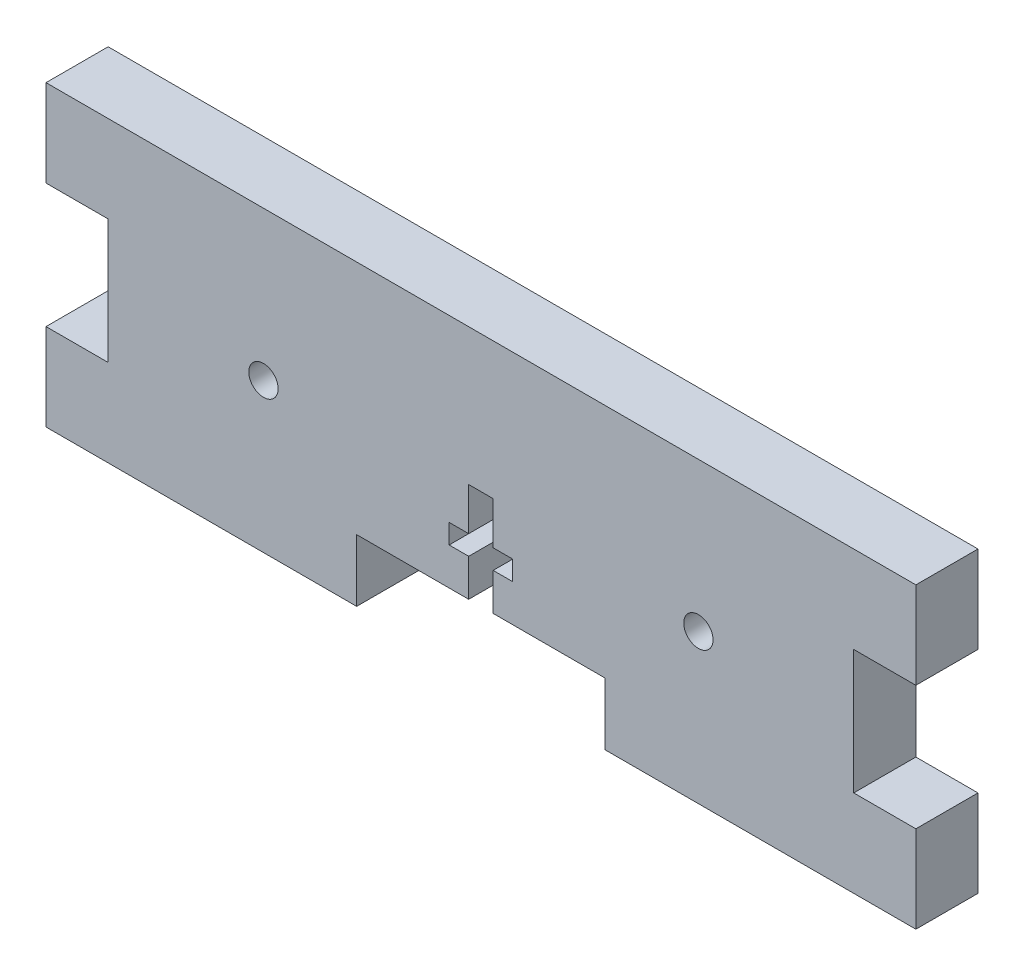
ISO-10303-21;
HEADER;
FILE_DESCRIPTION(('STEP AP214'),'2;1');
FILE_NAME('part.step','',(''),(''),'','','');
FILE_SCHEMA(('AUTOMOTIVE_DESIGN { 1 0 10303 214 1 1 1 1 }'));
ENDSEC;
DATA;
#1=APPLICATION_CONTEXT('core data for automotive mechanical design processes');
#2=APPLICATION_PROTOCOL_DEFINITION('international standard','automotive_design',2000,#1);
#3=PRODUCT_CONTEXT('',#1,'mechanical');
#4=PRODUCT('Part','Part','',(#3));
#5=PRODUCT_RELATED_PRODUCT_CATEGORY('part','',(#4));
#6=PRODUCT_DEFINITION_FORMATION('','',#4);
#7=PRODUCT_DEFINITION_CONTEXT('part definition',#1,'design');
#8=PRODUCT_DEFINITION('design','',#6,#7);
#9=PRODUCT_DEFINITION_SHAPE('','',#8);
#10=(LENGTH_UNIT() NAMED_UNIT(*) SI_UNIT(.MILLI.,.METRE.));
#11=(NAMED_UNIT(*) PLANE_ANGLE_UNIT() SI_UNIT($,.RADIAN.));
#12=(NAMED_UNIT(*) SI_UNIT($,.STERADIAN.) SOLID_ANGLE_UNIT());
#13=UNCERTAINTY_MEASURE_WITH_UNIT(LENGTH_MEASURE(1.E-05),#10,'distance_accuracy_value','');
#14=(GEOMETRIC_REPRESENTATION_CONTEXT(3) GLOBAL_UNCERTAINTY_ASSIGNED_CONTEXT((#13)) GLOBAL_UNIT_ASSIGNED_CONTEXT((#10,
#11,#12)) REPRESENTATION_CONTEXT('',''));
#15=CARTESIAN_POINT('',(0.,0.,0.));
#16=DIRECTION('',(0.,0.,1.));
#17=DIRECTION('',(1.,0.,0.));
#18=AXIS2_PLACEMENT_3D('',#15,#16,#17);
#19=CARTESIAN_POINT('',(31.75,6.35,0.));
#20=DIRECTION('',(0.,1.,0.));
#21=DIRECTION('',(0.,0.,1.));
#22=AXIS2_PLACEMENT_3D('',#19,#20,#21);
#23=PLANE('',#22);
#24=DIRECTION('',(0.,0.,1.));
#25=VECTOR('',#24,1.);
#26=CARTESIAN_POINT('',(43.2,6.35,0.));
#27=LINE('',#26,#25);
#28=CARTESIAN_POINT('',(43.2,6.35,0.));
#29=VERTEX_POINT('',#28);
#30=CARTESIAN_POINT('',(43.2,6.35,6.35));
#31=VERTEX_POINT('',#30);
#32=EDGE_CURVE('E310',#29,#31,#27,.T.);
#33=ORIENTED_EDGE('',*,*,#32,.T.);
#34=DIRECTION('',(-1.,0.,0.));
#35=VECTOR('',#34,1.);
#36=CARTESIAN_POINT('',(31.75,6.35,6.35));
#37=LINE('',#36,#35);
#38=CARTESIAN_POINT('',(31.75,6.35,6.35));
#39=VERTEX_POINT('',#38);
#40=EDGE_CURVE('E341',#31,#39,#37,.T.);
#41=ORIENTED_EDGE('',*,*,#40,.T.);
#42=DIRECTION('',(0.,0.,1.));
#43=VECTOR('',#42,1.);
#44=CARTESIAN_POINT('',(31.75,6.35,0.));
#45=LINE('',#44,#43);
#46=CARTESIAN_POINT('',(31.75,6.35,0.));
#47=VERTEX_POINT('',#46);
#48=EDGE_CURVE('E344',#47,#39,#45,.T.);
#49=ORIENTED_EDGE('',*,*,#48,.F.);
#50=DIRECTION('',(-1.,0.,0.));
#51=VECTOR('',#50,1.);
#52=CARTESIAN_POINT('',(31.75,6.35,0.));
#53=LINE('',#52,#51);
#54=EDGE_CURVE('E334',#29,#47,#53,.T.);
#55=ORIENTED_EDGE('',*,*,#54,.F.);
#56=EDGE_LOOP('',(#33,#41,#49,#55));
#57=FACE_BOUND('',#56,.T.);
#58=ADVANCED_FACE('F33',(#57),#23,.F.);
#59=CARTESIAN_POINT('',(0.,0.,6.35));
#60=DIRECTION('',(0.,1.,0.));
#61=DIRECTION('',(0.,0.,1.));
#62=AXIS2_PLACEMENT_3D('',#59,#60,#61);
#63=PLANE('',#62);
#64=DIRECTION('',(1.,0.,0.));
#65=VECTOR('',#64,1.);
#66=CARTESIAN_POINT('',(0.,0.,0.));
#67=LINE('',#66,#65);
#68=CARTESIAN_POINT('',(0.,0.,0.));
#69=VERTEX_POINT('',#68);
#70=CARTESIAN_POINT('',(31.75,0.,0.));
#71=VERTEX_POINT('',#70);
#72=EDGE_CURVE('E386',#69,#71,#67,.T.);
#73=ORIENTED_EDGE('',*,*,#72,.T.);
#74=DIRECTION('',(0.,0.,1.));
#75=VECTOR('',#74,1.);
#76=CARTESIAN_POINT('',(31.75,0.,0.));
#77=LINE('',#76,#75);
#78=CARTESIAN_POINT('',(31.75,0.,6.35));
#79=VERTEX_POINT('',#78);
#80=EDGE_CURVE('E336',#71,#79,#77,.T.);
#81=ORIENTED_EDGE('',*,*,#80,.T.);
#82=DIRECTION('',(1.,0.,0.));
#83=VECTOR('',#82,1.);
#84=CARTESIAN_POINT('',(0.,0.,6.35));
#85=LINE('',#84,#83);
#86=CARTESIAN_POINT('',(0.,0.,6.35));
#87=VERTEX_POINT('',#86);
#88=EDGE_CURVE('E359',#87,#79,#85,.T.);
#89=ORIENTED_EDGE('',*,*,#88,.F.);
#90=DIRECTION('',(0.,0.,-1.));
#91=VECTOR('',#90,1.);
#92=CARTESIAN_POINT('',(0.,0.,6.35));
#93=LINE('',#92,#91);
#94=EDGE_CURVE('E11',#87,#69,#93,.T.);
#95=ORIENTED_EDGE('',*,*,#94,.T.);
#96=EDGE_LOOP('',(#73,#81,#89,#95));
#97=FACE_BOUND('',#96,.T.);
#98=ADVANCED_FACE('F513',(#97),#63,.F.);
#99=CARTESIAN_POINT('',(0.,0.,6.35));
#100=DIRECTION('',(1.,0.,0.));
#101=DIRECTION('',(0.,0.,-1.));
#102=AXIS2_PLACEMENT_3D('',#99,#100,#101);
#103=PLANE('',#102);
#104=DIRECTION('',(0.,-1.,0.));
#105=VECTOR('',#104,1.);
#106=CARTESIAN_POINT('',(0.,0.,0.));
#107=LINE('',#106,#105);
#108=CARTESIAN_POINT('',(0.,8.89,0.));
#109=VERTEX_POINT('',#108);
#110=EDGE_CURVE('E347',#109,#69,#107,.T.);
#111=ORIENTED_EDGE('',*,*,#110,.T.);
#112=ORIENTED_EDGE('',*,*,#94,.F.);
#113=DIRECTION('',(0.,-1.,0.));
#114=VECTOR('',#113,1.);
#115=CARTESIAN_POINT('',(0.,0.,6.35));
#116=LINE('',#115,#114);
#117=CARTESIAN_POINT('',(0.,8.89,6.35));
#118=VERTEX_POINT('',#117);
#119=EDGE_CURVE('E354',#118,#87,#116,.T.);
#120=ORIENTED_EDGE('',*,*,#119,.F.);
#121=DIRECTION('',(0.,0.,-1.));
#122=VECTOR('',#121,1.);
#123=CARTESIAN_POINT('',(0.,8.89,6.35));
#124=LINE('',#123,#122);
#125=EDGE_CURVE('E382',#118,#109,#124,.T.);
#126=ORIENTED_EDGE('',*,*,#125,.T.);
#127=EDGE_LOOP('',(#111,#112,#120,#126));
#128=FACE_BOUND('',#127,.T.);
#129=ADVANCED_FACE('F35',(#128),#103,.F.);
#130=CARTESIAN_POINT('',(57.15,0.,6.35));
#131=VERTEX_POINT('',#130);
#132=CARTESIAN_POINT('',(88.9,0.,6.35));
#133=VERTEX_POINT('',#132);
#134=EDGE_CURVE('E357',#131,#133,#85,.T.);
#135=ORIENTED_EDGE('',*,*,#134,.F.);
#136=DIRECTION('',(0.,0.,1.));
#137=VECTOR('',#136,1.);
#138=CARTESIAN_POINT('',(57.15,0.,0.));
#139=LINE('',#138,#137);
#140=CARTESIAN_POINT('',(57.15,0.,0.));
#141=VERTEX_POINT('',#140);
#142=EDGE_CURVE('E350',#141,#131,#139,.T.);
#143=ORIENTED_EDGE('',*,*,#142,.F.);
#144=CARTESIAN_POINT('',(88.9,0.,0.));
#145=VERTEX_POINT('',#144);
#146=EDGE_CURVE('E385',#141,#145,#67,.T.);
#147=ORIENTED_EDGE('',*,*,#146,.T.);
#148=DIRECTION('',(0.,0.,-1.));
#149=VECTOR('',#148,1.);
#150=CARTESIAN_POINT('',(88.9,0.,6.35));
#151=LINE('',#150,#149);
#152=EDGE_CURVE('E41',#133,#145,#151,.T.);
#153=ORIENTED_EDGE('',*,*,#152,.F.);
#154=EDGE_LOOP('',(#135,#143,#147,#153));
#155=FACE_BOUND('',#154,.T.);
#156=ADVANCED_FACE('F466',(#155),#63,.F.);
#157=CARTESIAN_POINT('',(88.9,0.,6.35));
#158=DIRECTION('',(-1.,0.,0.));
#159=DIRECTION('',(0.,0.,1.));
#160=AXIS2_PLACEMENT_3D('',#157,#158,#159);
#161=PLANE('',#160);
#162=DIRECTION('',(0.,1.,0.));
#163=VECTOR('',#162,1.);
#164=CARTESIAN_POINT('',(88.9,0.,0.));
#165=LINE('',#164,#163);
#166=CARTESIAN_POINT('',(88.9,8.89,0.));
#167=VERTEX_POINT('',#166);
#168=EDGE_CURVE('E389',#145,#167,#165,.T.);
#169=ORIENTED_EDGE('',*,*,#168,.T.);
#170=DIRECTION('',(0.,0.,-1.));
#171=VECTOR('',#170,1.);
#172=CARTESIAN_POINT('',(88.9,8.89,6.35));
#173=LINE('',#172,#171);
#174=CARTESIAN_POINT('',(88.9,8.89,6.35));
#175=VERTEX_POINT('',#174);
#176=EDGE_CURVE('E434',#175,#167,#173,.T.);
#177=ORIENTED_EDGE('',*,*,#176,.F.);
#178=DIRECTION('',(0.,1.,0.));
#179=VECTOR('',#178,1.);
#180=CARTESIAN_POINT('',(88.9,0.,6.35));
#181=LINE('',#180,#179);
#182=EDGE_CURVE('E362',#133,#175,#181,.T.);
#183=ORIENTED_EDGE('',*,*,#182,.F.);
#184=ORIENTED_EDGE('',*,*,#152,.T.);
#185=EDGE_LOOP('',(#169,#177,#183,#184));
#186=FACE_BOUND('',#185,.T.);
#187=ADVANCED_FACE('F441',(#186),#161,.F.);
#188=CARTESIAN_POINT('',(88.9,8.89,6.35));
#189=DIRECTION('',(0.,-1.,0.));
#190=DIRECTION('',(0.,0.,-1.));
#191=AXIS2_PLACEMENT_3D('',#188,#189,#190);
#192=PLANE('',#191);
#193=DIRECTION('',(-1.,0.,0.));
#194=VECTOR('',#193,1.);
#195=CARTESIAN_POINT('',(88.9,8.89,0.));
#196=LINE('',#195,#194);
#197=CARTESIAN_POINT('',(82.55,8.89,0.));
#198=VERTEX_POINT('',#197);
#199=EDGE_CURVE('E391',#167,#198,#196,.T.);
#200=ORIENTED_EDGE('',*,*,#199,.T.);
#201=DIRECTION('',(0.,0.,-1.));
#202=VECTOR('',#201,1.);
#203=CARTESIAN_POINT('',(82.55,8.89,6.35));
#204=LINE('',#203,#202);
#205=CARTESIAN_POINT('',(82.55,8.89,6.35));
#206=VERTEX_POINT('',#205);
#207=EDGE_CURVE('E431',#206,#198,#204,.T.);
#208=ORIENTED_EDGE('',*,*,#207,.F.);
#209=DIRECTION('',(-1.,0.,0.));
#210=VECTOR('',#209,1.);
#211=CARTESIAN_POINT('',(88.9,8.89,6.35));
#212=LINE('',#211,#210);
#213=EDGE_CURVE('E364',#175,#206,#212,.T.);
#214=ORIENTED_EDGE('',*,*,#213,.F.);
#215=ORIENTED_EDGE('',*,*,#176,.T.);
#216=EDGE_LOOP('',(#200,#208,#214,#215));
#217=FACE_BOUND('',#216,.T.);
#218=ADVANCED_FACE('F451',(#217),#192,.F.);
#219=CARTESIAN_POINT('',(82.55,21.59,6.35));
#220=DIRECTION('',(-1.,0.,0.));
#221=DIRECTION('',(0.,0.,1.));
#222=AXIS2_PLACEMENT_3D('',#219,#220,#221);
#223=PLANE('',#222);
#224=DIRECTION('',(0.,1.,0.));
#225=VECTOR('',#224,1.);
#226=CARTESIAN_POINT('',(82.55,21.59,0.));
#227=LINE('',#226,#225);
#228=CARTESIAN_POINT('',(82.55,21.59,0.));
#229=VERTEX_POINT('',#228);
#230=EDGE_CURVE('E393',#198,#229,#227,.T.);
#231=ORIENTED_EDGE('',*,*,#230,.T.);
#232=DIRECTION('',(0.,0.,-1.));
#233=VECTOR('',#232,1.);
#234=CARTESIAN_POINT('',(82.55,21.59,6.35));
#235=LINE('',#234,#233);
#236=CARTESIAN_POINT('',(82.55,21.59,6.35));
#237=VERTEX_POINT('',#236);
#238=EDGE_CURVE('E428',#237,#229,#235,.T.);
#239=ORIENTED_EDGE('',*,*,#238,.F.);
#240=DIRECTION('',(0.,1.,0.));
#241=VECTOR('',#240,1.);
#242=CARTESIAN_POINT('',(82.55,21.59,6.35));
#243=LINE('',#242,#241);
#244=EDGE_CURVE('E366',#206,#237,#243,.T.);
#245=ORIENTED_EDGE('',*,*,#244,.F.);
#246=ORIENTED_EDGE('',*,*,#207,.T.);
#247=EDGE_LOOP('',(#231,#239,#245,#246));
#248=FACE_BOUND('',#247,.T.);
#249=ADVANCED_FACE('F455',(#248),#223,.F.);
#250=CARTESIAN_POINT('',(88.9,21.59,6.35));
#251=DIRECTION('',(0.,1.,0.));
#252=DIRECTION('',(0.,0.,1.));
#253=AXIS2_PLACEMENT_3D('',#250,#251,#252);
#254=PLANE('',#253);
#255=DIRECTION('',(1.,0.,0.));
#256=VECTOR('',#255,1.);
#257=CARTESIAN_POINT('',(88.9,21.59,0.));
#258=LINE('',#257,#256);
#259=CARTESIAN_POINT('',(88.9,21.59,0.));
#260=VERTEX_POINT('',#259);
#261=EDGE_CURVE('E395',#229,#260,#258,.T.);
#262=ORIENTED_EDGE('',*,*,#261,.T.);
#263=DIRECTION('',(0.,0.,-1.));
#264=VECTOR('',#263,1.);
#265=CARTESIAN_POINT('',(88.9,21.59,6.35));
#266=LINE('',#265,#264);
#267=CARTESIAN_POINT('',(88.9,21.59,6.35));
#268=VERTEX_POINT('',#267);
#269=EDGE_CURVE('E425',#268,#260,#266,.T.);
#270=ORIENTED_EDGE('',*,*,#269,.F.);
#271=DIRECTION('',(1.,0.,0.));
#272=VECTOR('',#271,1.);
#273=CARTESIAN_POINT('',(88.9,21.59,6.35));
#274=LINE('',#273,#272);
#275=EDGE_CURVE('E368',#237,#268,#274,.T.);
#276=ORIENTED_EDGE('',*,*,#275,.F.);
#277=ORIENTED_EDGE('',*,*,#238,.T.);
#278=EDGE_LOOP('',(#262,#270,#276,#277));
#279=FACE_BOUND('',#278,.T.);
#280=ADVANCED_FACE('F548',(#279),#254,.F.);
#281=CARTESIAN_POINT('',(88.9,21.59,6.35));
#282=DIRECTION('',(-1.,0.,0.));
#283=DIRECTION('',(0.,0.,1.));
#284=AXIS2_PLACEMENT_3D('',#281,#282,#283);
#285=PLANE('',#284);
#286=DIRECTION('',(0.,1.,0.));
#287=VECTOR('',#286,1.);
#288=CARTESIAN_POINT('',(88.9,21.59,0.));
#289=LINE('',#288,#287);
#290=CARTESIAN_POINT('',(88.9,30.48,0.));
#291=VERTEX_POINT('',#290);
#292=EDGE_CURVE('E397',#260,#291,#289,.T.);
#293=ORIENTED_EDGE('',*,*,#292,.T.);
#294=DIRECTION('',(0.,0.,-1.));
#295=VECTOR('',#294,1.);
#296=CARTESIAN_POINT('',(88.9,30.48,6.35));
#297=LINE('',#296,#295);
#298=CARTESIAN_POINT('',(88.9,30.48,6.35));
#299=VERTEX_POINT('',#298);
#300=EDGE_CURVE('E422',#299,#291,#297,.T.);
#301=ORIENTED_EDGE('',*,*,#300,.F.);
#302=DIRECTION('',(0.,1.,0.));
#303=VECTOR('',#302,1.);
#304=CARTESIAN_POINT('',(88.9,21.59,6.35));
#305=LINE('',#304,#303);
#306=EDGE_CURVE('E370',#268,#299,#305,.T.);
#307=ORIENTED_EDGE('',*,*,#306,.F.);
#308=ORIENTED_EDGE('',*,*,#269,.T.);
#309=EDGE_LOOP('',(#293,#301,#307,#308));
#310=FACE_BOUND('',#309,.T.);
#311=ADVANCED_FACE('F546',(#310),#285,.F.);
#312=CARTESIAN_POINT('',(0.,30.48,6.35));
#313=DIRECTION('',(0.,-1.,0.));
#314=DIRECTION('',(0.,0.,-1.));
#315=AXIS2_PLACEMENT_3D('',#312,#313,#314);
#316=PLANE('',#315);
#317=DIRECTION('',(-1.,0.,0.));
#318=VECTOR('',#317,1.);
#319=CARTESIAN_POINT('',(0.,30.48,0.));
#320=LINE('',#319,#318);
#321=CARTESIAN_POINT('',(0.,30.48,0.));
#322=VERTEX_POINT('',#321);
#323=EDGE_CURVE('E399',#291,#322,#320,.T.);
#324=ORIENTED_EDGE('',*,*,#323,.T.);
#325=DIRECTION('',(0.,0.,-1.));
#326=VECTOR('',#325,1.);
#327=CARTESIAN_POINT('',(0.,30.48,6.35));
#328=LINE('',#327,#326);
#329=CARTESIAN_POINT('',(0.,30.48,6.35));
#330=VERTEX_POINT('',#329);
#331=EDGE_CURVE('E419',#330,#322,#328,.T.);
#332=ORIENTED_EDGE('',*,*,#331,.F.);
#333=DIRECTION('',(-1.,0.,0.));
#334=VECTOR('',#333,1.);
#335=CARTESIAN_POINT('',(0.,30.48,6.35));
#336=LINE('',#335,#334);
#337=EDGE_CURVE('E372',#299,#330,#336,.T.);
#338=ORIENTED_EDGE('',*,*,#337,.F.);
#339=ORIENTED_EDGE('',*,*,#300,.T.);
#340=EDGE_LOOP('',(#324,#332,#338,#339));
#341=FACE_BOUND('',#340,.T.);
#342=ADVANCED_FACE('F542',(#341),#316,.F.);
#343=CARTESIAN_POINT('',(0.,21.59,6.35));
#344=DIRECTION('',(1.,0.,0.));
#345=DIRECTION('',(0.,0.,-1.));
#346=AXIS2_PLACEMENT_3D('',#343,#344,#345);
#347=PLANE('',#346);
#348=DIRECTION('',(0.,-1.,0.));
#349=VECTOR('',#348,1.);
#350=CARTESIAN_POINT('',(0.,21.59,0.));
#351=LINE('',#350,#349);
#352=CARTESIAN_POINT('',(0.,21.59,0.));
#353=VERTEX_POINT('',#352);
#354=EDGE_CURVE('E401',#322,#353,#351,.T.);
#355=ORIENTED_EDGE('',*,*,#354,.T.);
#356=DIRECTION('',(0.,0.,-1.));
#357=VECTOR('',#356,1.);
#358=CARTESIAN_POINT('',(0.,21.59,6.35));
#359=LINE('',#358,#357);
#360=CARTESIAN_POINT('',(0.,21.59,6.35));
#361=VERTEX_POINT('',#360);
#362=EDGE_CURVE('E416',#361,#353,#359,.T.);
#363=ORIENTED_EDGE('',*,*,#362,.F.);
#364=DIRECTION('',(0.,-1.,0.));
#365=VECTOR('',#364,1.);
#366=CARTESIAN_POINT('',(0.,21.59,6.35));
#367=LINE('',#366,#365);
#368=EDGE_CURVE('E374',#330,#361,#367,.T.);
#369=ORIENTED_EDGE('',*,*,#368,.F.);
#370=ORIENTED_EDGE('',*,*,#331,.T.);
#371=EDGE_LOOP('',(#355,#363,#369,#370));
#372=FACE_BOUND('',#371,.T.);
#373=ADVANCED_FACE('F537',(#372),#347,.F.);
#374=CARTESIAN_POINT('',(0.,21.59,6.35));
#375=DIRECTION('',(0.,1.,0.));
#376=DIRECTION('',(0.,0.,1.));
#377=AXIS2_PLACEMENT_3D('',#374,#375,#376);
#378=PLANE('',#377);
#379=DIRECTION('',(1.,0.,0.));
#380=VECTOR('',#379,1.);
#381=CARTESIAN_POINT('',(0.,21.59,0.));
#382=LINE('',#381,#380);
#383=CARTESIAN_POINT('',(6.35,21.59,0.));
#384=VERTEX_POINT('',#383);
#385=EDGE_CURVE('E403',#353,#384,#382,.T.);
#386=ORIENTED_EDGE('',*,*,#385,.T.);
#387=DIRECTION('',(0.,0.,-1.));
#388=VECTOR('',#387,1.);
#389=CARTESIAN_POINT('',(6.35,21.59,6.35));
#390=LINE('',#389,#388);
#391=CARTESIAN_POINT('',(6.35,21.59,6.35));
#392=VERTEX_POINT('',#391);
#393=EDGE_CURVE('E413',#392,#384,#390,.T.);
#394=ORIENTED_EDGE('',*,*,#393,.F.);
#395=DIRECTION('',(1.,0.,0.));
#396=VECTOR('',#395,1.);
#397=CARTESIAN_POINT('',(0.,21.59,6.35));
#398=LINE('',#397,#396);
#399=EDGE_CURVE('E376',#361,#392,#398,.T.);
#400=ORIENTED_EDGE('',*,*,#399,.F.);
#401=ORIENTED_EDGE('',*,*,#362,.T.);
#402=EDGE_LOOP('',(#386,#394,#400,#401));
#403=FACE_BOUND('',#402,.T.);
#404=ADVANCED_FACE('F531',(#403),#378,.F.);
#405=CARTESIAN_POINT('',(6.35,21.59,6.35));
#406=DIRECTION('',(1.,0.,0.));
#407=DIRECTION('',(0.,0.,-1.));
#408=AXIS2_PLACEMENT_3D('',#405,#406,#407);
#409=PLANE('',#408);
#410=DIRECTION('',(0.,-1.,0.));
#411=VECTOR('',#410,1.);
#412=CARTESIAN_POINT('',(6.35,21.59,0.));
#413=LINE('',#412,#411);
#414=CARTESIAN_POINT('',(6.35,8.89,0.));
#415=VERTEX_POINT('',#414);
#416=EDGE_CURVE('E405',#384,#415,#413,.T.);
#417=ORIENTED_EDGE('',*,*,#416,.T.);
#418=DIRECTION('',(0.,0.,-1.));
#419=VECTOR('',#418,1.);
#420=CARTESIAN_POINT('',(6.35,8.89,6.35));
#421=LINE('',#420,#419);
#422=CARTESIAN_POINT('',(6.35,8.89,6.35));
#423=VERTEX_POINT('',#422);
#424=EDGE_CURVE('E410',#423,#415,#421,.T.);
#425=ORIENTED_EDGE('',*,*,#424,.F.);
#426=DIRECTION('',(0.,-1.,0.));
#427=VECTOR('',#426,1.);
#428=CARTESIAN_POINT('',(6.35,21.59,6.35));
#429=LINE('',#428,#427);
#430=EDGE_CURVE('E378',#392,#423,#429,.T.);
#431=ORIENTED_EDGE('',*,*,#430,.F.);
#432=ORIENTED_EDGE('',*,*,#393,.T.);
#433=EDGE_LOOP('',(#417,#425,#431,#432));
#434=FACE_BOUND('',#433,.T.);
#435=ADVANCED_FACE('F527',(#434),#409,.F.);
#436=CARTESIAN_POINT('',(0.,8.89,6.35));
#437=DIRECTION('',(0.,-1.,0.));
#438=DIRECTION('',(0.,0.,-1.));
#439=AXIS2_PLACEMENT_3D('',#436,#437,#438);
#440=PLANE('',#439);
#441=DIRECTION('',(-1.,0.,0.));
#442=VECTOR('',#441,1.);
#443=CARTESIAN_POINT('',(0.,8.89,0.));
#444=LINE('',#443,#442);
#445=EDGE_CURVE('E358',#415,#109,#444,.T.);
#446=ORIENTED_EDGE('',*,*,#445,.T.);
#447=ORIENTED_EDGE('',*,*,#125,.F.);
#448=DIRECTION('',(-1.,0.,0.));
#449=VECTOR('',#448,1.);
#450=CARTESIAN_POINT('',(0.,8.89,6.35));
#451=LINE('',#450,#449);
#452=EDGE_CURVE('E380',#423,#118,#451,.T.);
#453=ORIENTED_EDGE('',*,*,#452,.F.);
#454=ORIENTED_EDGE('',*,*,#424,.T.);
#455=EDGE_LOOP('',(#446,#447,#453,#454));
#456=FACE_BOUND('',#455,.T.);
#457=ADVANCED_FACE('F522',(#456),#440,.F.);
#458=CARTESIAN_POINT('',(0.,0.,6.35));
#459=DIRECTION('',(0.,0.,-1.));
#460=DIRECTION('',(-1.,0.,0.));
#461=AXIS2_PLACEMENT_3D('',#458,#459,#460);
#462=PLANE('',#461);
#463=DIRECTION('',(1.,0.,0.));
#464=VECTOR('',#463,1.);
#465=CARTESIAN_POINT('',(45.7,10.16,6.35));
#466=LINE('',#465,#464);
#467=CARTESIAN_POINT('',(45.7,10.16,6.35));
#468=VERTEX_POINT('',#467);
#469=CARTESIAN_POINT('',(47.7,10.16,6.35));
#470=VERTEX_POINT('',#469);
#471=EDGE_CURVE('E279',#468,#470,#466,.T.);
#472=ORIENTED_EDGE('',*,*,#471,.F.);
#473=DIRECTION('',(0.,1.,0.));
#474=VECTOR('',#473,1.);
#475=CARTESIAN_POINT('',(45.7,6.35,6.35));
#476=LINE('',#475,#474);
#477=CARTESIAN_POINT('',(45.7,6.35,6.35));
#478=VERTEX_POINT('',#477);
#479=EDGE_CURVE('E276',#478,#468,#476,.T.);
#480=ORIENTED_EDGE('',*,*,#479,.F.);
#481=CARTESIAN_POINT('',(57.15,6.35,6.35));
#482=VERTEX_POINT('',#481);
#483=EDGE_CURVE('E331',#482,#478,#37,.T.);
#484=ORIENTED_EDGE('',*,*,#483,.F.);
#485=DIRECTION('',(0.,1.,0.));
#486=VECTOR('',#485,1.);
#487=CARTESIAN_POINT('',(57.15,0.,6.35));
#488=LINE('',#487,#486);
#489=EDGE_CURVE('E338',#131,#482,#488,.T.);
#490=ORIENTED_EDGE('',*,*,#489,.F.);
#491=ORIENTED_EDGE('',*,*,#134,.T.);
#492=ORIENTED_EDGE('',*,*,#182,.T.);
#493=ORIENTED_EDGE('',*,*,#213,.T.);
#494=ORIENTED_EDGE('',*,*,#244,.T.);
#495=ORIENTED_EDGE('',*,*,#275,.T.);
#496=ORIENTED_EDGE('',*,*,#306,.T.);
#497=ORIENTED_EDGE('',*,*,#337,.T.);
#498=ORIENTED_EDGE('',*,*,#368,.T.);
#499=ORIENTED_EDGE('',*,*,#399,.T.);
#500=ORIENTED_EDGE('',*,*,#430,.T.);
#501=ORIENTED_EDGE('',*,*,#452,.T.);
#502=ORIENTED_EDGE('',*,*,#119,.T.);
#503=ORIENTED_EDGE('',*,*,#88,.T.);
#504=DIRECTION('',(0.,-1.,0.));
#505=VECTOR('',#504,1.);
#506=CARTESIAN_POINT('',(31.75,0.,6.35));
#507=LINE('',#506,#505);
#508=EDGE_CURVE('E324',#39,#79,#507,.T.);
#509=ORIENTED_EDGE('',*,*,#508,.F.);
#510=ORIENTED_EDGE('',*,*,#40,.F.);
#511=DIRECTION('',(0.,1.,0.));
#512=VECTOR('',#511,1.);
#513=CARTESIAN_POINT('',(43.2,6.35,6.35));
#514=LINE('',#513,#512);
#515=CARTESIAN_POINT('',(43.2,10.16,6.35));
#516=VERTEX_POINT('',#515);
#517=EDGE_CURVE('E48',#31,#516,#514,.T.);
#518=ORIENTED_EDGE('',*,*,#517,.T.);
#519=DIRECTION('',(-1.,0.,0.));
#520=VECTOR('',#519,1.);
#521=CARTESIAN_POINT('',(43.2,10.16,6.35));
#522=LINE('',#521,#520);
#523=CARTESIAN_POINT('',(41.2,10.16,6.35));
#524=VERTEX_POINT('',#523);
#525=EDGE_CURVE('E272',#516,#524,#522,.T.);
#526=ORIENTED_EDGE('',*,*,#525,.T.);
#527=DIRECTION('',(0.,-1.,0.));
#528=VECTOR('',#527,1.);
#529=CARTESIAN_POINT('',(41.2,12.16,6.35));
#530=LINE('',#529,#528);
#531=CARTESIAN_POINT('',(41.2,12.16,6.35));
#532=VERTEX_POINT('',#531);
#533=EDGE_CURVE('E270',#532,#524,#530,.T.);
#534=ORIENTED_EDGE('',*,*,#533,.F.);
#535=DIRECTION('',(-1.,0.,0.));
#536=VECTOR('',#535,1.);
#537=CARTESIAN_POINT('',(43.2,12.16,6.35));
#538=LINE('',#537,#536);
#539=CARTESIAN_POINT('',(43.2,12.16,6.35));
#540=VERTEX_POINT('',#539);
#541=EDGE_CURVE('E226',#540,#532,#538,.T.);
#542=ORIENTED_EDGE('',*,*,#541,.F.);
#543=DIRECTION('',(0.,1.,0.));
#544=VECTOR('',#543,1.);
#545=CARTESIAN_POINT('',(43.2,12.16,6.35));
#546=LINE('',#545,#544);
#547=CARTESIAN_POINT('',(43.2,16.51,6.35));
#548=VERTEX_POINT('',#547);
#549=EDGE_CURVE('E245',#540,#548,#546,.T.);
#550=ORIENTED_EDGE('',*,*,#549,.T.);
#551=DIRECTION('',(1.,0.,0.));
#552=VECTOR('',#551,1.);
#553=CARTESIAN_POINT('',(43.2,16.51,6.35));
#554=LINE('',#553,#552);
#555=CARTESIAN_POINT('',(45.7,16.51,6.35));
#556=VERTEX_POINT('',#555);
#557=EDGE_CURVE('E248',#548,#556,#554,.T.);
#558=ORIENTED_EDGE('',*,*,#557,.T.);
#559=DIRECTION('',(0.,1.,0.));
#560=VECTOR('',#559,1.);
#561=CARTESIAN_POINT('',(45.7,12.16,6.35));
#562=LINE('',#561,#560);
#563=CARTESIAN_POINT('',(45.7,12.16,6.35));
#564=VERTEX_POINT('',#563);
#565=EDGE_CURVE('E288',#564,#556,#562,.T.);
#566=ORIENTED_EDGE('',*,*,#565,.F.);
#567=DIRECTION('',(1.,0.,0.));
#568=VECTOR('',#567,1.);
#569=CARTESIAN_POINT('',(45.7,12.16,6.35));
#570=LINE('',#569,#568);
#571=CARTESIAN_POINT('',(47.7,12.16,6.35));
#572=VERTEX_POINT('',#571);
#573=EDGE_CURVE('E285',#564,#572,#570,.T.);
#574=ORIENTED_EDGE('',*,*,#573,.T.);
#575=DIRECTION('',(0.,-1.,0.));
#576=VECTOR('',#575,1.);
#577=CARTESIAN_POINT('',(47.7,12.16,6.35));
#578=LINE('',#577,#576);
#579=EDGE_CURVE('E282',#572,#470,#578,.T.);
#580=ORIENTED_EDGE('',*,*,#579,.T.);
#581=EDGE_LOOP('',(#472,#480,#484,#490,#491,#492,#493,#494,#495,#496,#497,#498,#499,#500,#501,
#502,#503,#509,#510,#518,#526,#534,#542,#550,#558,#566,#574,#580));
#582=FACE_BOUND('',#581,.T.);
#583=CARTESIAN_POINT('',(66.675,15.24,6.35));
#584=DIRECTION('',(0.,0.,1.));
#585=DIRECTION('',(1.,0.,0.));
#586=AXIS2_PLACEMENT_3D('',#583,#584,#585);
#587=CIRCLE('',#586,1.5);
#588=CARTESIAN_POINT('',(68.175,15.24,6.35));
#589=VERTEX_POINT('',#588);
#590=EDGE_CURVE('E295',#589,#589,#587,.T.);
#591=ORIENTED_EDGE('',*,*,#590,.F.);
#592=EDGE_LOOP('',(#591));
#593=FACE_BOUND('',#592,.T.);
#594=CARTESIAN_POINT('',(22.225,15.24,6.35));
#595=DIRECTION('',(0.,0.,1.));
#596=DIRECTION('',(1.,0.,0.));
#597=AXIS2_PLACEMENT_3D('',#594,#595,#596);
#598=CIRCLE('',#597,1.5);
#599=CARTESIAN_POINT('',(23.725,15.24,6.35));
#600=VERTEX_POINT('',#599);
#601=EDGE_CURVE('E318',#600,#600,#598,.T.);
#602=ORIENTED_EDGE('',*,*,#601,.F.);
#603=EDGE_LOOP('',(#602));
#604=FACE_BOUND('',#603,.T.);
#605=ADVANCED_FACE('F460',(#582,#593,#604),#462,.F.);
#606=CARTESIAN_POINT('',(0.,0.,0.));
#607=DIRECTION('',(0.,0.,-1.));
#608=DIRECTION('',(-1.,0.,0.));
#609=AXIS2_PLACEMENT_3D('',#606,#607,#608);
#610=PLANE('',#609);
#611=DIRECTION('',(0.,1.,0.));
#612=VECTOR('',#611,1.);
#613=CARTESIAN_POINT('',(45.7,6.35,0.));
#614=LINE('',#613,#612);
#615=CARTESIAN_POINT('',(45.7,6.35,0.));
#616=VERTEX_POINT('',#615);
#617=CARTESIAN_POINT('',(45.7,10.16,0.));
#618=VERTEX_POINT('',#617);
#619=EDGE_CURVE('E254',#616,#618,#614,.T.);
#620=ORIENTED_EDGE('',*,*,#619,.T.);
#621=DIRECTION('',(1.,0.,0.));
#622=VECTOR('',#621,1.);
#623=CARTESIAN_POINT('',(45.7,10.16,0.));
#624=LINE('',#623,#622);
#625=CARTESIAN_POINT('',(47.7,10.16,0.));
#626=VERTEX_POINT('',#625);
#627=EDGE_CURVE('E256',#618,#626,#624,.T.);
#628=ORIENTED_EDGE('',*,*,#627,.T.);
#629=DIRECTION('',(0.,-1.,0.));
#630=VECTOR('',#629,1.);
#631=CARTESIAN_POINT('',(47.7,12.16,0.));
#632=LINE('',#631,#630);
#633=CARTESIAN_POINT('',(47.7,12.16,0.));
#634=VERTEX_POINT('',#633);
#635=EDGE_CURVE('E259',#634,#626,#632,.T.);
#636=ORIENTED_EDGE('',*,*,#635,.F.);
#637=DIRECTION('',(1.,0.,0.));
#638=VECTOR('',#637,1.);
#639=CARTESIAN_POINT('',(45.7,12.16,0.));
#640=LINE('',#639,#638);
#641=CARTESIAN_POINT('',(45.7,12.16,0.));
#642=VERTEX_POINT('',#641);
#643=EDGE_CURVE('E261',#642,#634,#640,.T.);
#644=ORIENTED_EDGE('',*,*,#643,.F.);
#645=DIRECTION('',(0.,1.,0.));
#646=VECTOR('',#645,1.);
#647=CARTESIAN_POINT('',(45.7,12.16,0.));
#648=LINE('',#647,#646);
#649=CARTESIAN_POINT('',(45.7,16.51,0.));
#650=VERTEX_POINT('',#649);
#651=EDGE_CURVE('E263',#642,#650,#648,.T.);
#652=ORIENTED_EDGE('',*,*,#651,.T.);
#653=DIRECTION('',(1.,0.,0.));
#654=VECTOR('',#653,1.);
#655=CARTESIAN_POINT('',(43.2,16.51,0.));
#656=LINE('',#655,#654);
#657=CARTESIAN_POINT('',(43.2,16.51,0.));
#658=VERTEX_POINT('',#657);
#659=EDGE_CURVE('E266',#658,#650,#656,.T.);
#660=ORIENTED_EDGE('',*,*,#659,.F.);
#661=DIRECTION('',(0.,1.,0.));
#662=VECTOR('',#661,1.);
#663=CARTESIAN_POINT('',(43.2,12.16,0.));
#664=LINE('',#663,#662);
#665=CARTESIAN_POINT('',(43.2,12.16,0.));
#666=VERTEX_POINT('',#665);
#667=EDGE_CURVE('E231',#666,#658,#664,.T.);
#668=ORIENTED_EDGE('',*,*,#667,.F.);
#669=DIRECTION('',(-1.,0.,0.));
#670=VECTOR('',#669,1.);
#671=CARTESIAN_POINT('',(43.2,12.16,0.));
#672=LINE('',#671,#670);
#673=CARTESIAN_POINT('',(41.2,12.16,0.));
#674=VERTEX_POINT('',#673);
#675=EDGE_CURVE('E223',#666,#674,#672,.T.);
#676=ORIENTED_EDGE('',*,*,#675,.T.);
#677=DIRECTION('',(0.,-1.,0.));
#678=VECTOR('',#677,1.);
#679=CARTESIAN_POINT('',(41.2,12.16,0.));
#680=LINE('',#679,#678);
#681=CARTESIAN_POINT('',(41.2,10.16,0.));
#682=VERTEX_POINT('',#681);
#683=EDGE_CURVE('E235',#674,#682,#680,.T.);
#684=ORIENTED_EDGE('',*,*,#683,.T.);
#685=DIRECTION('',(-1.,0.,0.));
#686=VECTOR('',#685,1.);
#687=CARTESIAN_POINT('',(43.2,10.16,0.));
#688=LINE('',#687,#686);
#689=CARTESIAN_POINT('',(43.2,10.16,0.));
#690=VERTEX_POINT('',#689);
#691=EDGE_CURVE('E239',#690,#682,#688,.T.);
#692=ORIENTED_EDGE('',*,*,#691,.F.);
#693=DIRECTION('',(0.,1.,0.));
#694=VECTOR('',#693,1.);
#695=CARTESIAN_POINT('',(43.2,6.35,0.));
#696=LINE('',#695,#694);
#697=EDGE_CURVE('E252',#29,#690,#696,.T.);
#698=ORIENTED_EDGE('',*,*,#697,.F.);
#699=ORIENTED_EDGE('',*,*,#54,.T.);
#700=DIRECTION('',(0.,-1.,0.));
#701=VECTOR('',#700,1.);
#702=CARTESIAN_POINT('',(31.75,0.,0.));
#703=LINE('',#702,#701);
#704=EDGE_CURVE('E327',#47,#71,#703,.T.);
#705=ORIENTED_EDGE('',*,*,#704,.T.);
#706=ORIENTED_EDGE('',*,*,#72,.F.);
#707=ORIENTED_EDGE('',*,*,#110,.F.);
#708=ORIENTED_EDGE('',*,*,#445,.F.);
#709=ORIENTED_EDGE('',*,*,#416,.F.);
#710=ORIENTED_EDGE('',*,*,#385,.F.);
#711=ORIENTED_EDGE('',*,*,#354,.F.);
#712=ORIENTED_EDGE('',*,*,#323,.F.);
#713=ORIENTED_EDGE('',*,*,#292,.F.);
#714=ORIENTED_EDGE('',*,*,#261,.F.);
#715=ORIENTED_EDGE('',*,*,#230,.F.);
#716=ORIENTED_EDGE('',*,*,#199,.F.);
#717=ORIENTED_EDGE('',*,*,#168,.F.);
#718=ORIENTED_EDGE('',*,*,#146,.F.);
#719=DIRECTION('',(0.,1.,0.));
#720=VECTOR('',#719,1.);
#721=CARTESIAN_POINT('',(57.15,0.,0.));
#722=LINE('',#721,#720);
#723=CARTESIAN_POINT('',(57.15,6.35,0.));
#724=VERTEX_POINT('',#723);
#725=EDGE_CURVE('E330',#141,#724,#722,.T.);
#726=ORIENTED_EDGE('',*,*,#725,.T.);
#727=EDGE_CURVE('E56',#724,#616,#53,.T.);
#728=ORIENTED_EDGE('',*,*,#727,.T.);
#729=EDGE_LOOP('',(#620,#628,#636,#644,#652,#660,#668,#676,#684,#692,#698,#699,#705,#706,#707,
#708,#709,#710,#711,#712,#713,#714,#715,#716,#717,#718,#726,#728));
#730=FACE_BOUND('',#729,.T.);
#731=CARTESIAN_POINT('',(66.675,15.24,0.));
#732=DIRECTION('',(0.,0.,1.));
#733=DIRECTION('',(1.,0.,0.));
#734=AXIS2_PLACEMENT_3D('',#731,#732,#733);
#735=CIRCLE('',#734,1.5);
#736=CARTESIAN_POINT('',(68.175,15.24,0.));
#737=VERTEX_POINT('',#736);
#738=EDGE_CURVE('E315',#737,#737,#735,.T.);
#739=ORIENTED_EDGE('',*,*,#738,.T.);
#740=EDGE_LOOP('',(#739));
#741=FACE_BOUND('',#740,.T.);
#742=CARTESIAN_POINT('',(22.225,15.24,0.));
#743=DIRECTION('',(0.,0.,1.));
#744=DIRECTION('',(1.,0.,0.));
#745=AXIS2_PLACEMENT_3D('',#742,#743,#744);
#746=CIRCLE('',#745,1.5);
#747=CARTESIAN_POINT('',(23.725,15.24,0.));
#748=VERTEX_POINT('',#747);
#749=EDGE_CURVE('E321',#748,#748,#746,.T.);
#750=ORIENTED_EDGE('',*,*,#749,.T.);
#751=EDGE_LOOP('',(#750));
#752=FACE_BOUND('',#751,.T.);
#753=ADVANCED_FACE('F242',(#730,#741,#752),#610,.T.);
#754=CARTESIAN_POINT('',(31.75,0.,0.));
#755=DIRECTION('',(-1.,0.,0.));
#756=DIRECTION('',(0.,0.,1.));
#757=AXIS2_PLACEMENT_3D('',#754,#755,#756);
#758=PLANE('',#757);
#759=ORIENTED_EDGE('',*,*,#508,.T.);
#760=ORIENTED_EDGE('',*,*,#80,.F.);
#761=ORIENTED_EDGE('',*,*,#704,.F.);
#762=ORIENTED_EDGE('',*,*,#48,.T.);
#763=EDGE_LOOP('',(#759,#760,#761,#762));
#764=FACE_BOUND('',#763,.T.);
#765=ADVANCED_FACE('F510',(#764),#758,.F.);
#766=ORIENTED_EDGE('',*,*,#483,.T.);
#767=DIRECTION('',(0.,0.,1.));
#768=VECTOR('',#767,1.);
#769=CARTESIAN_POINT('',(45.7,6.35,0.));
#770=LINE('',#769,#768);
#771=EDGE_CURVE('E308',#616,#478,#770,.T.);
#772=ORIENTED_EDGE('',*,*,#771,.F.);
#773=ORIENTED_EDGE('',*,*,#727,.F.);
#774=DIRECTION('',(0.,0.,1.));
#775=VECTOR('',#774,1.);
#776=CARTESIAN_POINT('',(57.15,6.35,0.));
#777=LINE('',#776,#775);
#778=EDGE_CURVE('E348',#724,#482,#777,.T.);
#779=ORIENTED_EDGE('',*,*,#778,.T.);
#780=EDGE_LOOP('',(#766,#772,#773,#779));
#781=FACE_BOUND('',#780,.T.);
#782=ADVANCED_FACE('F474',(#781),#23,.F.);
#783=CARTESIAN_POINT('',(57.15,0.,0.));
#784=DIRECTION('',(1.,0.,0.));
#785=DIRECTION('',(0.,0.,-1.));
#786=AXIS2_PLACEMENT_3D('',#783,#784,#785);
#787=PLANE('',#786);
#788=ORIENTED_EDGE('',*,*,#489,.T.);
#789=ORIENTED_EDGE('',*,*,#778,.F.);
#790=ORIENTED_EDGE('',*,*,#725,.F.);
#791=ORIENTED_EDGE('',*,*,#142,.T.);
#792=EDGE_LOOP('',(#788,#789,#790,#791));
#793=FACE_BOUND('',#792,.T.);
#794=ADVANCED_FACE('F468',(#793),#787,.F.);
#795=CARTESIAN_POINT('',(22.225,15.24,0.));
#796=DIRECTION('',(0.,0.,1.));
#797=DIRECTION('',(1.,0.,0.));
#798=AXIS2_PLACEMENT_3D('',#795,#796,#797);
#799=CYLINDRICAL_SURFACE('',#798,1.5);
#800=ORIENTED_EDGE('',*,*,#749,.F.);
#801=EDGE_LOOP('',(#800));
#802=FACE_BOUND('',#801,.T.);
#803=ORIENTED_EDGE('',*,*,#601,.T.);
#804=EDGE_LOOP('',(#803));
#805=FACE_BOUND('',#804,.T.);
#806=ADVANCED_FACE('F572',(#802,#805),#799,.F.);
#807=CARTESIAN_POINT('',(66.675,15.24,0.));
#808=DIRECTION('',(0.,0.,1.));
#809=DIRECTION('',(1.,0.,0.));
#810=AXIS2_PLACEMENT_3D('',#807,#808,#809);
#811=CYLINDRICAL_SURFACE('',#810,1.5);
#812=ORIENTED_EDGE('',*,*,#738,.F.);
#813=EDGE_LOOP('',(#812));
#814=FACE_BOUND('',#813,.T.);
#815=ORIENTED_EDGE('',*,*,#590,.T.);
#816=EDGE_LOOP('',(#815));
#817=FACE_BOUND('',#816,.T.);
#818=ADVANCED_FACE('F649',(#814,#817),#811,.F.);
#819=CARTESIAN_POINT('',(43.2,12.16,0.));
#820=DIRECTION('',(0.,1.,0.));
#821=DIRECTION('',(0.,0.,1.));
#822=AXIS2_PLACEMENT_3D('',#819,#820,#821);
#823=PLANE('',#822);
#824=ORIENTED_EDGE('',*,*,#541,.T.);
#825=DIRECTION('',(0.,0.,1.));
#826=VECTOR('',#825,1.);
#827=CARTESIAN_POINT('',(41.2,12.16,0.));
#828=LINE('',#827,#826);
#829=EDGE_CURVE('E219',#674,#532,#828,.T.);
#830=ORIENTED_EDGE('',*,*,#829,.F.);
#831=ORIENTED_EDGE('',*,*,#675,.F.);
#832=DIRECTION('',(0.,0.,1.));
#833=VECTOR('',#832,1.);
#834=CARTESIAN_POINT('',(43.2,12.16,0.));
#835=LINE('',#834,#833);
#836=EDGE_CURVE('E293',#666,#540,#835,.T.);
#837=ORIENTED_EDGE('',*,*,#836,.T.);
#838=EDGE_LOOP('',(#824,#830,#831,#837));
#839=FACE_BOUND('',#838,.T.);
#840=ADVANCED_FACE('F221',(#839),#823,.F.);
#841=CARTESIAN_POINT('',(43.2,12.16,0.));
#842=DIRECTION('',(1.,0.,0.));
#843=DIRECTION('',(0.,0.,-1.));
#844=AXIS2_PLACEMENT_3D('',#841,#842,#843);
#845=PLANE('',#844);
#846=ORIENTED_EDGE('',*,*,#549,.F.);
#847=ORIENTED_EDGE('',*,*,#836,.F.);
#848=ORIENTED_EDGE('',*,*,#667,.T.);
#849=DIRECTION('',(0.,0.,1.));
#850=VECTOR('',#849,1.);
#851=CARTESIAN_POINT('',(43.2,16.51,0.));
#852=LINE('',#851,#850);
#853=EDGE_CURVE('E296',#658,#548,#852,.T.);
#854=ORIENTED_EDGE('',*,*,#853,.T.);
#855=EDGE_LOOP('',(#846,#847,#848,#854));
#856=FACE_BOUND('',#855,.T.);
#857=ADVANCED_FACE('F497',(#856),#845,.T.);
#858=CARTESIAN_POINT('',(43.2,16.51,0.));
#859=DIRECTION('',(0.,-1.,0.));
#860=DIRECTION('',(0.,0.,-1.));
#861=AXIS2_PLACEMENT_3D('',#858,#859,#860);
#862=PLANE('',#861);
#863=ORIENTED_EDGE('',*,*,#557,.F.);
#864=ORIENTED_EDGE('',*,*,#853,.F.);
#865=ORIENTED_EDGE('',*,*,#659,.T.);
#866=DIRECTION('',(0.,0.,1.));
#867=VECTOR('',#866,1.);
#868=CARTESIAN_POINT('',(45.7,16.51,0.));
#869=LINE('',#868,#867);
#870=EDGE_CURVE('E298',#650,#556,#869,.T.);
#871=ORIENTED_EDGE('',*,*,#870,.T.);
#872=EDGE_LOOP('',(#863,#864,#865,#871));
#873=FACE_BOUND('',#872,.T.);
#874=ADVANCED_FACE('F493',(#873),#862,.T.);
#875=CARTESIAN_POINT('',(45.7,12.16,0.));
#876=DIRECTION('',(1.,0.,0.));
#877=DIRECTION('',(0.,0.,-1.));
#878=AXIS2_PLACEMENT_3D('',#875,#876,#877);
#879=PLANE('',#878);
#880=ORIENTED_EDGE('',*,*,#565,.T.);
#881=ORIENTED_EDGE('',*,*,#870,.F.);
#882=ORIENTED_EDGE('',*,*,#651,.F.);
#883=DIRECTION('',(0.,0.,1.));
#884=VECTOR('',#883,1.);
#885=CARTESIAN_POINT('',(45.7,12.16,0.));
#886=LINE('',#885,#884);
#887=EDGE_CURVE('E300',#642,#564,#886,.T.);
#888=ORIENTED_EDGE('',*,*,#887,.T.);
#889=EDGE_LOOP('',(#880,#881,#882,#888));
#890=FACE_BOUND('',#889,.T.);
#891=ADVANCED_FACE('F490',(#890),#879,.F.);
#892=CARTESIAN_POINT('',(45.7,12.16,0.));
#893=DIRECTION('',(0.,-1.,0.));
#894=DIRECTION('',(0.,0.,-1.));
#895=AXIS2_PLACEMENT_3D('',#892,#893,#894);
#896=PLANE('',#895);
#897=ORIENTED_EDGE('',*,*,#573,.F.);
#898=ORIENTED_EDGE('',*,*,#887,.F.);
#899=ORIENTED_EDGE('',*,*,#643,.T.);
#900=DIRECTION('',(0.,0.,1.));
#901=VECTOR('',#900,1.);
#902=CARTESIAN_POINT('',(47.7,12.16,0.));
#903=LINE('',#902,#901);
#904=EDGE_CURVE('E302',#634,#572,#903,.T.);
#905=ORIENTED_EDGE('',*,*,#904,.T.);
#906=EDGE_LOOP('',(#897,#898,#899,#905));
#907=FACE_BOUND('',#906,.T.);
#908=ADVANCED_FACE('F486',(#907),#896,.T.);
#909=CARTESIAN_POINT('',(47.7,12.16,0.));
#910=DIRECTION('',(-1.,0.,0.));
#911=DIRECTION('',(0.,-1.,0.));
#912=AXIS2_PLACEMENT_3D('',#909,#910,#911);
#913=PLANE('',#912);
#914=ORIENTED_EDGE('',*,*,#579,.F.);
#915=ORIENTED_EDGE('',*,*,#904,.F.);
#916=ORIENTED_EDGE('',*,*,#635,.T.);
#917=DIRECTION('',(0.,0.,1.));
#918=VECTOR('',#917,1.);
#919=CARTESIAN_POINT('',(47.7,10.16,0.));
#920=LINE('',#919,#918);
#921=EDGE_CURVE('E304',#626,#470,#920,.T.);
#922=ORIENTED_EDGE('',*,*,#921,.T.);
#923=EDGE_LOOP('',(#914,#915,#916,#922));
#924=FACE_BOUND('',#923,.T.);
#925=ADVANCED_FACE('F480',(#924),#913,.T.);
#926=CARTESIAN_POINT('',(45.7,10.16,0.));
#927=DIRECTION('',(0.,-1.,0.));
#928=DIRECTION('',(0.,0.,-1.));
#929=AXIS2_PLACEMENT_3D('',#926,#927,#928);
#930=PLANE('',#929);
#931=ORIENTED_EDGE('',*,*,#471,.T.);
#932=ORIENTED_EDGE('',*,*,#921,.F.);
#933=ORIENTED_EDGE('',*,*,#627,.F.);
#934=DIRECTION('',(0.,0.,1.));
#935=VECTOR('',#934,1.);
#936=CARTESIAN_POINT('',(45.7,10.16,0.));
#937=LINE('',#936,#935);
#938=EDGE_CURVE('E306',#618,#468,#937,.T.);
#939=ORIENTED_EDGE('',*,*,#938,.T.);
#940=EDGE_LOOP('',(#931,#932,#933,#939));
#941=FACE_BOUND('',#940,.T.);
#942=ADVANCED_FACE('F478',(#941),#930,.F.);
#943=CARTESIAN_POINT('',(45.7,6.35,0.));
#944=DIRECTION('',(1.,0.,0.));
#945=DIRECTION('',(0.,0.,-1.));
#946=AXIS2_PLACEMENT_3D('',#943,#944,#945);
#947=PLANE('',#946);
#948=ORIENTED_EDGE('',*,*,#479,.T.);
#949=ORIENTED_EDGE('',*,*,#938,.F.);
#950=ORIENTED_EDGE('',*,*,#619,.F.);
#951=ORIENTED_EDGE('',*,*,#771,.T.);
#952=EDGE_LOOP('',(#948,#949,#950,#951));
#953=FACE_BOUND('',#952,.T.);
#954=ADVANCED_FACE('F472',(#953),#947,.F.);
#955=CARTESIAN_POINT('',(43.2,6.35,0.));
#956=DIRECTION('',(1.,0.,0.));
#957=DIRECTION('',(0.,0.,-1.));
#958=AXIS2_PLACEMENT_3D('',#955,#956,#957);
#959=PLANE('',#958);
#960=ORIENTED_EDGE('',*,*,#517,.F.);
#961=ORIENTED_EDGE('',*,*,#32,.F.);
#962=ORIENTED_EDGE('',*,*,#697,.T.);
#963=DIRECTION('',(0.,0.,1.));
#964=VECTOR('',#963,1.);
#965=CARTESIAN_POINT('',(43.2,10.16,0.));
#966=LINE('',#965,#964);
#967=EDGE_CURVE('E312',#690,#516,#966,.T.);
#968=ORIENTED_EDGE('',*,*,#967,.T.);
#969=EDGE_LOOP('',(#960,#961,#962,#968));
#970=FACE_BOUND('',#969,.T.);
#971=ADVANCED_FACE('F716',(#970),#959,.T.);
#972=CARTESIAN_POINT('',(43.2,10.16,0.));
#973=DIRECTION('',(0.,1.,0.));
#974=DIRECTION('',(0.,0.,1.));
#975=AXIS2_PLACEMENT_3D('',#972,#973,#974);
#976=PLANE('',#975);
#977=ORIENTED_EDGE('',*,*,#525,.F.);
#978=ORIENTED_EDGE('',*,*,#967,.F.);
#979=ORIENTED_EDGE('',*,*,#691,.T.);
#980=DIRECTION('',(0.,0.,1.));
#981=VECTOR('',#980,1.);
#982=CARTESIAN_POINT('',(41.2,10.16,0.));
#983=LINE('',#982,#981);
#984=EDGE_CURVE('E230',#682,#524,#983,.T.);
#985=ORIENTED_EDGE('',*,*,#984,.T.);
#986=EDGE_LOOP('',(#977,#978,#979,#985));
#987=FACE_BOUND('',#986,.T.);
#988=ADVANCED_FACE('F502',(#987),#976,.T.);
#989=CARTESIAN_POINT('',(41.2,12.16,0.));
#990=DIRECTION('',(-1.,0.,0.));
#991=DIRECTION('',(0.,0.,1.));
#992=AXIS2_PLACEMENT_3D('',#989,#990,#991);
#993=PLANE('',#992);
#994=ORIENTED_EDGE('',*,*,#533,.T.);
#995=ORIENTED_EDGE('',*,*,#984,.F.);
#996=ORIENTED_EDGE('',*,*,#683,.F.);
#997=ORIENTED_EDGE('',*,*,#829,.T.);
#998=EDGE_LOOP('',(#994,#995,#996,#997));
#999=FACE_BOUND('',#998,.T.);
#1000=ADVANCED_FACE('F236',(#999),#993,.F.);
#1001=CLOSED_SHELL('',(#58,#98,#129,#156,#187,#218,#249,#280,#311,#342,#373,#404,#435,#457,#605,
#753,#765,#782,#794,#806,#818,#840,#857,#874,#891,#908,#925,#942,#954,#971,#988,#1000));
#1002=MANIFOLD_SOLID_BREP('B2',#1001);
#1003=ADVANCED_BREP_SHAPE_REPRESENTATION('',(#18,#1002),#14);
#1004=SHAPE_DEFINITION_REPRESENTATION(#9,#1003);
ENDSEC;
END-ISO-10303-21;
